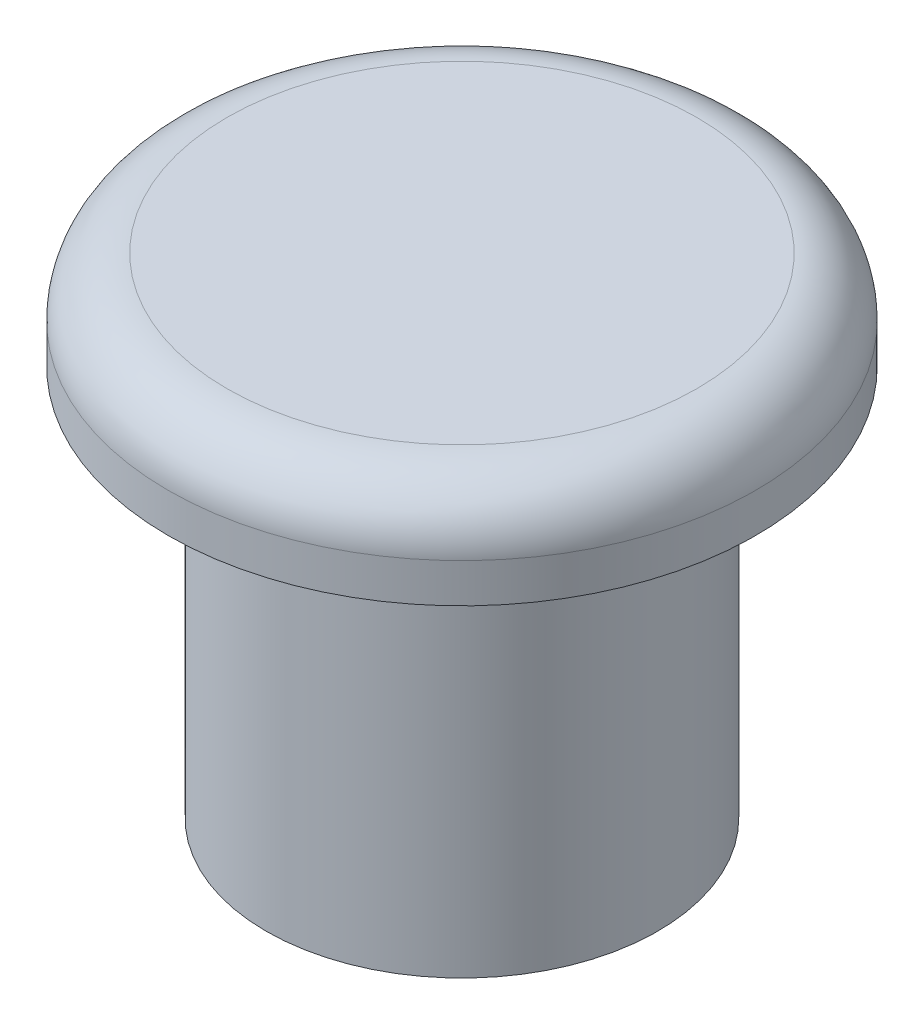
ISO-10303-21;
HEADER;
FILE_DESCRIPTION(('STEP AP214'),'2;1');
FILE_NAME('part.step','',(''),(''),'','','');
FILE_SCHEMA(('AUTOMOTIVE_DESIGN { 1 0 10303 214 1 1 1 1 }'));
ENDSEC;
DATA;
#1=APPLICATION_CONTEXT('core data for automotive mechanical design processes');
#2=APPLICATION_PROTOCOL_DEFINITION('international standard','automotive_design',2000,#1);
#3=PRODUCT_CONTEXT('',#1,'mechanical');
#4=PRODUCT('Part','Part','',(#3));
#5=PRODUCT_RELATED_PRODUCT_CATEGORY('part','',(#4));
#6=PRODUCT_DEFINITION_FORMATION('','',#4);
#7=PRODUCT_DEFINITION_CONTEXT('part definition',#1,'design');
#8=PRODUCT_DEFINITION('design','',#6,#7);
#9=PRODUCT_DEFINITION_SHAPE('','',#8);
#10=(LENGTH_UNIT() NAMED_UNIT(*) SI_UNIT(.MILLI.,.METRE.));
#11=(NAMED_UNIT(*) PLANE_ANGLE_UNIT() SI_UNIT($,.RADIAN.));
#12=(NAMED_UNIT(*) SI_UNIT($,.STERADIAN.) SOLID_ANGLE_UNIT());
#13=UNCERTAINTY_MEASURE_WITH_UNIT(LENGTH_MEASURE(1.E-05),#10,'distance_accuracy_value','');
#14=(GEOMETRIC_REPRESENTATION_CONTEXT(3) GLOBAL_UNCERTAINTY_ASSIGNED_CONTEXT((#13)) GLOBAL_UNIT_ASSIGNED_CONTEXT((#10,
#11,#12)) REPRESENTATION_CONTEXT('',''));
#15=CARTESIAN_POINT('',(0.,0.,0.));
#16=DIRECTION('',(0.,0.,1.));
#17=DIRECTION('',(1.,0.,0.));
#18=AXIS2_PLACEMENT_3D('',#15,#16,#17);
#19=CARTESIAN_POINT('',(0.,0.5,0.));
#20=DIRECTION('',(0.,-1.,0.));
#21=DIRECTION('',(0.,0.,-1.));
#22=AXIS2_PLACEMENT_3D('',#19,#20,#21);
#23=CYLINDRICAL_SURFACE('',#22,1.5);
#24=CARTESIAN_POINT('',(0.,0.2,0.));
#25=DIRECTION('',(0.,1.,0.));
#26=DIRECTION('',(0.,0.,1.));
#27=AXIS2_PLACEMENT_3D('',#24,#25,#26);
#28=CIRCLE('',#27,1.5);
#29=CARTESIAN_POINT('',(0.,0.2,1.5));
#30=VERTEX_POINT('',#29);
#31=EDGE_CURVE('E10',#30,#30,#28,.F.);
#32=ORIENTED_EDGE('',*,*,#31,.T.);
#33=EDGE_LOOP('',(#32));
#34=FACE_BOUND('',#33,.T.);
#35=CARTESIAN_POINT('',(0.,0.,0.));
#36=DIRECTION('',(0.,1.,0.));
#37=DIRECTION('',(0.,0.,1.));
#38=AXIS2_PLACEMENT_3D('',#35,#36,#37);
#39=CIRCLE('',#38,1.5);
#40=CARTESIAN_POINT('',(0.,0.,1.5));
#41=VERTEX_POINT('',#40);
#42=EDGE_CURVE('E54',#41,#41,#39,.T.);
#43=ORIENTED_EDGE('',*,*,#42,.T.);
#44=EDGE_LOOP('',(#43));
#45=FACE_BOUND('',#44,.T.);
#46=ADVANCED_FACE('F41',(#34,#45),#23,.T.);
#47=CARTESIAN_POINT('',(0.,0.5,0.));
#48=DIRECTION('',(0.,1.,0.));
#49=DIRECTION('',(0.,0.,1.));
#50=AXIS2_PLACEMENT_3D('',#47,#48,#49);
#51=PLANE('',#50);
#52=CARTESIAN_POINT('',(0.,0.5,0.));
#53=DIRECTION('',(0.,1.,0.));
#54=DIRECTION('',(0.,0.,1.));
#55=AXIS2_PLACEMENT_3D('',#52,#53,#54);
#56=CIRCLE('',#55,1.2);
#57=CARTESIAN_POINT('',(0.,0.5,1.2));
#58=VERTEX_POINT('',#57);
#59=EDGE_CURVE('E49',#58,#58,#56,.T.);
#60=ORIENTED_EDGE('',*,*,#59,.T.);
#61=EDGE_LOOP('',(#60));
#62=FACE_BOUND('',#61,.T.);
#63=ADVANCED_FACE('F84',(#62),#51,.T.);
#64=CARTESIAN_POINT('',(0.,0.,0.));
#65=DIRECTION('',(0.,1.,0.));
#66=DIRECTION('',(0.,0.,1.));
#67=AXIS2_PLACEMENT_3D('',#64,#65,#66);
#68=PLANE('',#67);
#69=CARTESIAN_POINT('',(0.,0.,0.));
#70=DIRECTION('',(0.,1.,0.));
#71=DIRECTION('',(0.,0.,1.));
#72=AXIS2_PLACEMENT_3D('',#69,#70,#71);
#73=CIRCLE('',#72,1.);
#74=CARTESIAN_POINT('',(0.,0.,1.));
#75=VERTEX_POINT('',#74);
#76=EDGE_CURVE('E62',#75,#75,#73,.T.);
#77=ORIENTED_EDGE('',*,*,#76,.T.);
#78=EDGE_LOOP('',(#77));
#79=FACE_BOUND('',#78,.T.);
#80=ORIENTED_EDGE('',*,*,#42,.F.);
#81=EDGE_LOOP('',(#80));
#82=FACE_BOUND('',#81,.T.);
#83=ADVANCED_FACE('F81',(#79,#82),#68,.F.);
#84=CARTESIAN_POINT('',(0.,-2.,0.));
#85=DIRECTION('',(0.,1.,0.));
#86=DIRECTION('',(0.,0.,1.));
#87=AXIS2_PLACEMENT_3D('',#84,#85,#86);
#88=CYLINDRICAL_SURFACE('',#87,1.);
#89=CARTESIAN_POINT('',(0.,-2.,0.));
#90=DIRECTION('',(0.,1.,0.));
#91=DIRECTION('',(0.,0.,1.));
#92=AXIS2_PLACEMENT_3D('',#89,#90,#91);
#93=CIRCLE('',#92,1.);
#94=CARTESIAN_POINT('',(0.,-2.,1.));
#95=VERTEX_POINT('',#94);
#96=EDGE_CURVE('E59',#95,#95,#93,.T.);
#97=ORIENTED_EDGE('',*,*,#96,.T.);
#98=EDGE_LOOP('',(#97));
#99=FACE_BOUND('',#98,.T.);
#100=ORIENTED_EDGE('',*,*,#76,.F.);
#101=EDGE_LOOP('',(#100));
#102=FACE_BOUND('',#101,.T.);
#103=ADVANCED_FACE('F70',(#99,#102),#88,.T.);
#104=CARTESIAN_POINT('',(0.,-2.,0.));
#105=DIRECTION('',(0.,1.,0.));
#106=DIRECTION('',(0.,0.,1.));
#107=AXIS2_PLACEMENT_3D('',#104,#105,#106);
#108=PLANE('',#107);
#109=ORIENTED_EDGE('',*,*,#96,.F.);
#110=EDGE_LOOP('',(#109));
#111=FACE_BOUND('',#110,.T.);
#112=ADVANCED_FACE('F73',(#111),#108,.F.);
#113=CARTESIAN_POINT('',(0.,0.2,0.));
#114=DIRECTION('',(0.,1.,0.));
#115=DIRECTION('',(0.,0.,1.));
#116=AXIS2_PLACEMENT_3D('',#113,#114,#115);
#117=TOROIDAL_SURFACE('',#116,1.2,0.3);
#118=ORIENTED_EDGE('',*,*,#31,.F.);
#119=EDGE_LOOP('',(#118));
#120=FACE_BOUND('',#119,.T.);
#121=ORIENTED_EDGE('',*,*,#59,.F.);
#122=EDGE_LOOP('',(#121));
#123=FACE_BOUND('',#122,.T.);
#124=ADVANCED_FACE('F43',(#120,#123),#117,.T.);
#125=CLOSED_SHELL('',(#46,#63,#83,#103,#112,#124));
#126=MANIFOLD_SOLID_BREP('B2',#125);
#127=ADVANCED_BREP_SHAPE_REPRESENTATION('',(#18,#126),#14);
#128=SHAPE_DEFINITION_REPRESENTATION(#9,#127);
ENDSEC;
END-ISO-10303-21;
